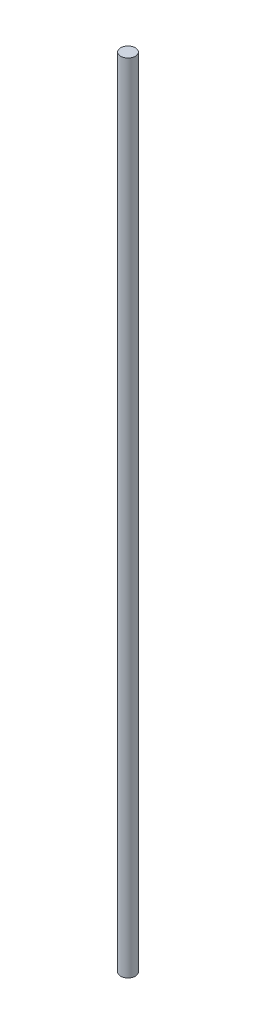
ISO-10303-21;
HEADER;
FILE_DESCRIPTION(('STEP AP214'),'2;1');
FILE_NAME('part.step','',(''),(''),'','','');
FILE_SCHEMA(('AUTOMOTIVE_DESIGN { 1 0 10303 214 1 1 1 1 }'));
ENDSEC;
DATA;
#1=APPLICATION_CONTEXT('core data for automotive mechanical design processes');
#2=APPLICATION_PROTOCOL_DEFINITION('international standard','automotive_design',2000,#1);
#3=PRODUCT_CONTEXT('',#1,'mechanical');
#4=PRODUCT('Part','Part','',(#3));
#5=PRODUCT_RELATED_PRODUCT_CATEGORY('part','',(#4));
#6=PRODUCT_DEFINITION_FORMATION('','',#4);
#7=PRODUCT_DEFINITION_CONTEXT('part definition',#1,'design');
#8=PRODUCT_DEFINITION('design','',#6,#7);
#9=PRODUCT_DEFINITION_SHAPE('','',#8);
#10=(LENGTH_UNIT() NAMED_UNIT(*) SI_UNIT(.MILLI.,.METRE.));
#11=(NAMED_UNIT(*) PLANE_ANGLE_UNIT() SI_UNIT($,.RADIAN.));
#12=(NAMED_UNIT(*) SI_UNIT($,.STERADIAN.) SOLID_ANGLE_UNIT());
#13=UNCERTAINTY_MEASURE_WITH_UNIT(LENGTH_MEASURE(1.E-05),#10,'distance_accuracy_value','');
#14=(GEOMETRIC_REPRESENTATION_CONTEXT(3) GLOBAL_UNCERTAINTY_ASSIGNED_CONTEXT((#13)) GLOBAL_UNIT_ASSIGNED_CONTEXT((#10,
#11,#12)) REPRESENTATION_CONTEXT('',''));
#15=CARTESIAN_POINT('',(0.,0.,0.));
#16=DIRECTION('',(0.,0.,1.));
#17=DIRECTION('',(1.,0.,0.));
#18=AXIS2_PLACEMENT_3D('',#15,#16,#17);
#19=CARTESIAN_POINT('',(0.,1300.,0.));
#20=DIRECTION('',(0.,-1.,0.));
#21=DIRECTION('',(0.,0.,-1.));
#22=AXIS2_PLACEMENT_3D('',#19,#20,#21);
#23=CYLINDRICAL_SURFACE('',#22,12.);
#24=CARTESIAN_POINT('',(0.,1300.,0.));
#25=DIRECTION('',(0.,1.,0.));
#26=DIRECTION('',(0.,0.,1.));
#27=AXIS2_PLACEMENT_3D('',#24,#25,#26);
#28=CIRCLE('',#27,12.);
#29=CARTESIAN_POINT('',(0.,1300.,12.));
#30=VERTEX_POINT('',#29);
#31=EDGE_CURVE('E10',#30,#30,#28,.T.);
#32=ORIENTED_EDGE('',*,*,#31,.F.);
#33=EDGE_LOOP('',(#32));
#34=FACE_BOUND('',#33,.T.);
#35=CARTESIAN_POINT('',(0.,0.,0.));
#36=DIRECTION('',(0.,1.,0.));
#37=DIRECTION('',(0.,0.,1.));
#38=AXIS2_PLACEMENT_3D('',#35,#36,#37);
#39=CIRCLE('',#38,12.);
#40=CARTESIAN_POINT('',(0.,0.,12.));
#41=VERTEX_POINT('',#40);
#42=EDGE_CURVE('E34',#41,#41,#39,.T.);
#43=ORIENTED_EDGE('',*,*,#42,.T.);
#44=EDGE_LOOP('',(#43));
#45=FACE_BOUND('',#44,.T.);
#46=ADVANCED_FACE('F31',(#34,#45),#23,.T.);
#47=CARTESIAN_POINT('',(0.,1300.,0.));
#48=DIRECTION('',(0.,1.,0.));
#49=DIRECTION('',(0.,0.,1.));
#50=AXIS2_PLACEMENT_3D('',#47,#48,#49);
#51=PLANE('',#50);
#52=ORIENTED_EDGE('',*,*,#31,.T.);
#53=EDGE_LOOP('',(#52));
#54=FACE_BOUND('',#53,.T.);
#55=ADVANCED_FACE('F46',(#54),#51,.T.);
#56=CARTESIAN_POINT('',(0.,0.,0.));
#57=DIRECTION('',(0.,1.,0.));
#58=DIRECTION('',(0.,0.,1.));
#59=AXIS2_PLACEMENT_3D('',#56,#57,#58);
#60=PLANE('',#59);
#61=ORIENTED_EDGE('',*,*,#42,.F.);
#62=EDGE_LOOP('',(#61));
#63=FACE_BOUND('',#62,.T.);
#64=ADVANCED_FACE('F44',(#63),#60,.F.);
#65=CLOSED_SHELL('',(#46,#55,#64));
#66=MANIFOLD_SOLID_BREP('B2',#65);
#67=ADVANCED_BREP_SHAPE_REPRESENTATION('',(#18,#66),#14);
#68=SHAPE_DEFINITION_REPRESENTATION(#9,#67);
ENDSEC;
END-ISO-10303-21;
